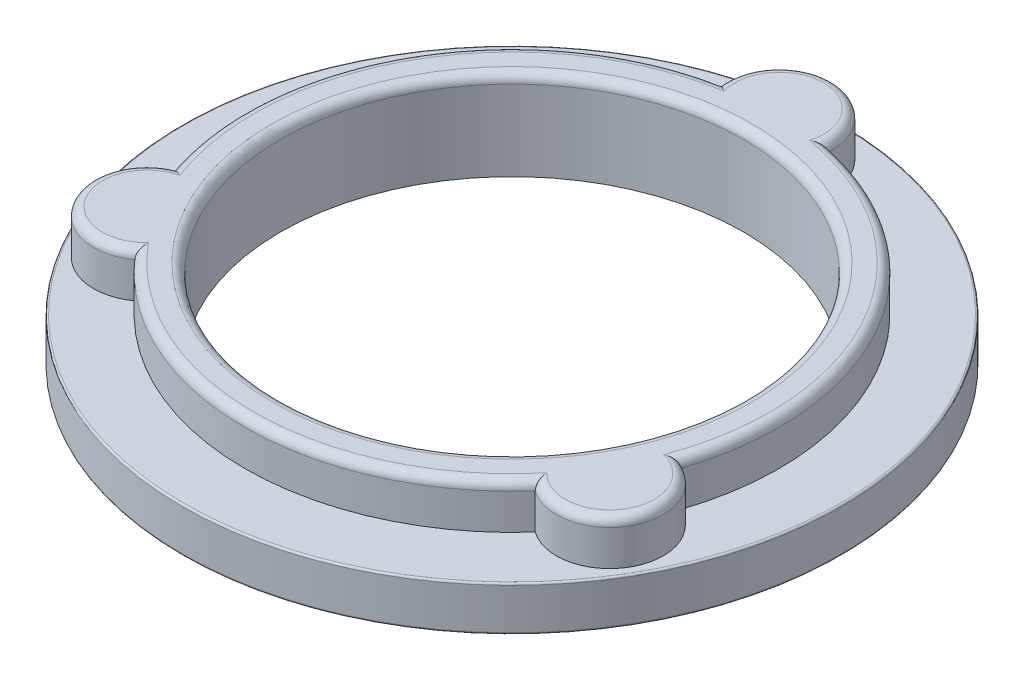
ISO-10303-21;
HEADER;
FILE_DESCRIPTION(('STEP AP214'),'2;1');
FILE_NAME('part.step','',(''),(''),'','','');
FILE_SCHEMA(('AUTOMOTIVE_DESIGN { 1 0 10303 214 1 1 1 1 }'));
ENDSEC;
DATA;
#1=APPLICATION_CONTEXT('core data for automotive mechanical design processes');
#2=APPLICATION_PROTOCOL_DEFINITION('international standard','automotive_design',2000,#1);
#3=PRODUCT_CONTEXT('',#1,'mechanical');
#4=PRODUCT('Part','Part','',(#3));
#5=PRODUCT_RELATED_PRODUCT_CATEGORY('part','',(#4));
#6=PRODUCT_DEFINITION_FORMATION('','',#4);
#7=PRODUCT_DEFINITION_CONTEXT('part definition',#1,'design');
#8=PRODUCT_DEFINITION('design','',#6,#7);
#9=PRODUCT_DEFINITION_SHAPE('','',#8);
#10=(LENGTH_UNIT() NAMED_UNIT(*) SI_UNIT(.MILLI.,.METRE.));
#11=(NAMED_UNIT(*) PLANE_ANGLE_UNIT() SI_UNIT($,.RADIAN.));
#12=(NAMED_UNIT(*) SI_UNIT($,.STERADIAN.) SOLID_ANGLE_UNIT());
#13=UNCERTAINTY_MEASURE_WITH_UNIT(LENGTH_MEASURE(1.E-05),#10,'distance_accuracy_value','');
#14=(GEOMETRIC_REPRESENTATION_CONTEXT(3) GLOBAL_UNCERTAINTY_ASSIGNED_CONTEXT((#13)) GLOBAL_UNIT_ASSIGNED_CONTEXT((#10,
#11,#12)) REPRESENTATION_CONTEXT('',''));
#15=CARTESIAN_POINT('',(0.,0.,0.));
#16=DIRECTION('',(0.,0.,1.));
#17=DIRECTION('',(1.,0.,0.));
#18=AXIS2_PLACEMENT_3D('',#15,#16,#17);
#19=CARTESIAN_POINT('',(0.,2.5,0.));
#20=DIRECTION('',(0.,-1.,0.));
#21=DIRECTION('',(0.,0.,-1.));
#22=AXIS2_PLACEMENT_3D('',#19,#20,#21);
#23=CYLINDRICAL_SURFACE('',#22,13.);
#24=CARTESIAN_POINT('',(0.,4.5,0.));
#25=DIRECTION('',(0.,1.,0.));
#26=DIRECTION('',(0.,0.,1.));
#27=AXIS2_PLACEMENT_3D('',#24,#25,#26);
#28=CIRCLE('',#27,13.);
#29=CARTESIAN_POINT('',(0.,4.5,13.));
#30=VERTEX_POINT('',#29);
#31=EDGE_CURVE('E205',#30,#30,#28,.T.);
#32=ORIENTED_EDGE('',*,*,#31,.T.);
#33=EDGE_LOOP('',(#32));
#34=FACE_BOUND('',#33,.T.);
#35=CARTESIAN_POINT('',(0.,0.,0.));
#36=DIRECTION('',(0.,1.,0.));
#37=DIRECTION('',(0.,0.,1.));
#38=AXIS2_PLACEMENT_3D('',#35,#36,#37);
#39=CIRCLE('',#38,13.);
#40=CARTESIAN_POINT('',(0.,0.,13.));
#41=VERTEX_POINT('',#40);
#42=EDGE_CURVE('E119',#41,#41,#39,.T.);
#43=ORIENTED_EDGE('',*,*,#42,.F.);
#44=EDGE_LOOP('',(#43));
#45=FACE_BOUND('',#44,.T.);
#46=ADVANCED_FACE('F39',(#34,#45),#23,.F.);
#47=CARTESIAN_POINT('',(0.,2.5,0.));
#48=DIRECTION('',(0.,-1.,0.));
#49=DIRECTION('',(0.,0.,-1.));
#50=AXIS2_PLACEMENT_3D('',#47,#48,#49);
#51=CYLINDRICAL_SURFACE('',#50,18.5);
#52=CARTESIAN_POINT('',(0.,0.0999999999999998,0.));
#53=DIRECTION('',(0.,1.,0.));
#54=DIRECTION('',(0.,0.,1.));
#55=AXIS2_PLACEMENT_3D('',#52,#53,#54);
#56=CIRCLE('',#55,18.5);
#57=CARTESIAN_POINT('',(0.,0.0999999999999998,18.5));
#58=VERTEX_POINT('',#57);
#59=EDGE_CURVE('E283',#58,#58,#56,.T.);
#60=ORIENTED_EDGE('',*,*,#59,.T.);
#61=EDGE_LOOP('',(#60));
#62=FACE_BOUND('',#61,.T.);
#63=CARTESIAN_POINT('',(0.,2.4,0.));
#64=DIRECTION('',(0.,1.,0.));
#65=DIRECTION('',(0.,0.,1.));
#66=AXIS2_PLACEMENT_3D('',#63,#64,#65);
#67=CIRCLE('',#66,18.5);
#68=CARTESIAN_POINT('',(0.,2.4,18.5));
#69=VERTEX_POINT('',#68);
#70=EDGE_CURVE('E209',#69,#69,#67,.F.);
#71=ORIENTED_EDGE('',*,*,#70,.T.);
#72=EDGE_LOOP('',(#71));
#73=FACE_BOUND('',#72,.T.);
#74=ADVANCED_FACE('F298',(#62,#73),#51,.T.);
#75=CARTESIAN_POINT('',(0.,2.5,0.));
#76=DIRECTION('',(0.,1.,0.));
#77=DIRECTION('',(0.,0.,1.));
#78=AXIS2_PLACEMENT_3D('',#75,#76,#77);
#79=PLANE('',#78);
#80=CARTESIAN_POINT('',(0.,2.5,0.));
#81=DIRECTION('',(0.,1.,0.));
#82=DIRECTION('',(0.,0.,1.));
#83=AXIS2_PLACEMENT_3D('',#80,#81,#82);
#84=CIRCLE('',#83,18.4);
#85=CARTESIAN_POINT('',(0.,2.5,18.4));
#86=VERTEX_POINT('',#85);
#87=EDGE_CURVE('E11',#86,#86,#84,.T.);
#88=ORIENTED_EDGE('',*,*,#87,.T.);
#89=EDGE_LOOP('',(#88));
#90=FACE_BOUND('',#89,.T.);
#91=CARTESIAN_POINT('',(12.9903810567665,2.5,7.50000000000006));
#92=DIRECTION('',(0.,1.,0.));
#93=DIRECTION('',(0.,0.,1.));
#94=AXIS2_PLACEMENT_3D('',#91,#92,#93);
#95=CIRCLE('',#94,3.00000000000001);
#96=CARTESIAN_POINT('',(11.2380922799713,2.5,9.93505319094218));
#97=VERTEX_POINT('',#96);
#98=CARTESIAN_POINT('',(14.2230545912912,2.5,4.76494680905793));
#99=VERTEX_POINT('',#98);
#100=EDGE_CURVE('E114',#97,#99,#95,.T.);
#101=ORIENTED_EDGE('',*,*,#100,.F.);
#102=CARTESIAN_POINT('',(0.,2.5,0.));
#103=DIRECTION('',(0.,1.,0.));
#104=DIRECTION('',(0.,0.,1.));
#105=AXIS2_PLACEMENT_3D('',#102,#103,#104);
#106=CIRCLE('',#105,15.);
#107=CARTESIAN_POINT('',(-11.2380922799714,2.5,9.93505319094202));
#108=VERTEX_POINT('',#107);
#109=EDGE_CURVE('E123',#108,#97,#106,.T.);
#110=ORIENTED_EDGE('',*,*,#109,.F.);
#111=CARTESIAN_POINT('',(-12.9903810567666,2.5,7.49999999999988));
#112=DIRECTION('',(0.,1.,0.));
#113=DIRECTION('',(0.,0.,1.));
#114=AXIS2_PLACEMENT_3D('',#111,#112,#113);
#115=CIRCLE('',#114,3.00000000000001);
#116=CARTESIAN_POINT('',(-14.2230545912912,2.5,4.76494680905774));
#117=VERTEX_POINT('',#116);
#118=EDGE_CURVE('E146',#117,#108,#115,.T.);
#119=ORIENTED_EDGE('',*,*,#118,.F.);
#120=CARTESIAN_POINT('',(-2.98496231131988,2.5,-14.7));
#121=VERTEX_POINT('',#120);
#122=EDGE_CURVE('E133',#121,#117,#106,.T.);
#123=ORIENTED_EDGE('',*,*,#122,.F.);
#124=CARTESIAN_POINT('',(0.,2.5,-15.));
#125=DIRECTION('',(0.,1.,0.));
#126=DIRECTION('',(0.,0.,1.));
#127=AXIS2_PLACEMENT_3D('',#124,#125,#126);
#128=CIRCLE('',#127,3.00000000000001);
#129=CARTESIAN_POINT('',(2.98496231131988,2.5,-14.7));
#130=VERTEX_POINT('',#129);
#131=EDGE_CURVE('E141',#130,#121,#128,.T.);
#132=ORIENTED_EDGE('',*,*,#131,.F.);
#133=EDGE_CURVE('E134',#99,#130,#106,.T.);
#134=ORIENTED_EDGE('',*,*,#133,.F.);
#135=EDGE_LOOP('',(#101,#110,#119,#123,#132,#134));
#136=FACE_BOUND('',#135,.T.);
#137=ADVANCED_FACE('F135',(#90,#136),#79,.T.);
#138=CARTESIAN_POINT('',(0.,0.,0.));
#139=DIRECTION('',(0.,1.,0.));
#140=DIRECTION('',(0.,0.,1.));
#141=AXIS2_PLACEMENT_3D('',#138,#139,#140);
#142=PLANE('',#141);
#143=CARTESIAN_POINT('',(0.,0.,0.));
#144=DIRECTION('',(0.,1.,0.));
#145=DIRECTION('',(0.,0.,1.));
#146=AXIS2_PLACEMENT_3D('',#143,#144,#145);
#147=CIRCLE('',#146,18.4);
#148=CARTESIAN_POINT('',(0.,0.,18.4));
#149=VERTEX_POINT('',#148);
#150=EDGE_CURVE('E48',#149,#149,#147,.F.);
#151=ORIENTED_EDGE('',*,*,#150,.T.);
#152=EDGE_LOOP('',(#151));
#153=FACE_BOUND('',#152,.T.);
#154=ORIENTED_EDGE('',*,*,#42,.T.);
#155=EDGE_LOOP('',(#154));
#156=FACE_BOUND('',#155,.T.);
#157=ADVANCED_FACE('F290',(#153,#156),#142,.F.);
#158=CARTESIAN_POINT('',(0.,5.,0.));
#159=DIRECTION('',(0.,-1.,0.));
#160=DIRECTION('',(0.,0.,-1.));
#161=AXIS2_PLACEMENT_3D('',#158,#159,#160);
#162=CYLINDRICAL_SURFACE('',#161,15.);
#163=DIRECTION('',(0.,-1.,0.));
#164=VECTOR('',#163,1.);
#165=CARTESIAN_POINT('',(11.2380922799713,5.,9.93505319094218));
#166=LINE('',#165,#164);
#167=CARTESIAN_POINT('',(11.2380922799713,4.5,9.93505319094218));
#168=VERTEX_POINT('',#167);
#169=EDGE_CURVE('E110',#168,#97,#166,.T.);
#170=ORIENTED_EDGE('',*,*,#169,.F.);
#171=CARTESIAN_POINT('',(0.,4.5,0.));
#172=DIRECTION('',(0.,1.,0.));
#173=DIRECTION('',(0.,0.,1.));
#174=AXIS2_PLACEMENT_3D('',#171,#172,#173);
#175=CIRCLE('',#174,15.);
#176=CARTESIAN_POINT('',(-11.2380922799714,4.5,9.93505319094202));
#177=VERTEX_POINT('',#176);
#178=EDGE_CURVE('E202',#168,#177,#175,.F.);
#179=ORIENTED_EDGE('',*,*,#178,.T.);
#180=DIRECTION('',(0.,-1.,0.));
#181=VECTOR('',#180,1.);
#182=CARTESIAN_POINT('',(-11.2380922799714,5.,9.93505319094202));
#183=LINE('',#182,#181);
#184=EDGE_CURVE('E126',#177,#108,#183,.T.);
#185=ORIENTED_EDGE('',*,*,#184,.T.);
#186=ORIENTED_EDGE('',*,*,#109,.T.);
#187=EDGE_LOOP('',(#170,#179,#185,#186));
#188=FACE_BOUND('',#187,.T.);
#189=ADVANCED_FACE('F124',(#188),#162,.T.);
#190=CARTESIAN_POINT('',(12.9903810567665,5.,7.50000000000006));
#191=DIRECTION('',(0.,-1.,0.));
#192=DIRECTION('',(0.,0.,-1.));
#193=AXIS2_PLACEMENT_3D('',#190,#191,#192);
#194=CYLINDRICAL_SURFACE('',#193,3.00000000000001);
#195=DIRECTION('',(0.,-1.,0.));
#196=VECTOR('',#195,1.);
#197=CARTESIAN_POINT('',(14.2230545912912,5.,4.76494680905793));
#198=LINE('',#197,#196);
#199=CARTESIAN_POINT('',(14.2230545912912,4.5,4.76494680905793));
#200=VERTEX_POINT('',#199);
#201=EDGE_CURVE('E120',#200,#99,#198,.T.);
#202=ORIENTED_EDGE('',*,*,#201,.F.);
#203=CARTESIAN_POINT('',(12.9903810567665,4.5,7.50000000000006));
#204=DIRECTION('',(0.,1.,0.));
#205=DIRECTION('',(0.,0.,1.));
#206=AXIS2_PLACEMENT_3D('',#203,#204,#205);
#207=CIRCLE('',#206,3.00000000000001);
#208=EDGE_CURVE('E55',#200,#168,#207,.F.);
#209=ORIENTED_EDGE('',*,*,#208,.T.);
#210=ORIENTED_EDGE('',*,*,#169,.T.);
#211=ORIENTED_EDGE('',*,*,#100,.T.);
#212=EDGE_LOOP('',(#202,#209,#210,#211));
#213=FACE_BOUND('',#212,.T.);
#214=ADVANCED_FACE('F112',(#213),#194,.T.);
#215=DIRECTION('',(0.,-1.,0.));
#216=VECTOR('',#215,1.);
#217=CARTESIAN_POINT('',(2.98496231131988,5.,-14.7));
#218=LINE('',#217,#216);
#219=CARTESIAN_POINT('',(2.98496231131988,4.5,-14.7));
#220=VERTEX_POINT('',#219);
#221=EDGE_CURVE('E157',#220,#130,#218,.T.);
#222=ORIENTED_EDGE('',*,*,#221,.F.);
#223=CARTESIAN_POINT('',(0.,4.5,0.));
#224=DIRECTION('',(0.,1.,0.));
#225=DIRECTION('',(0.,0.,1.));
#226=AXIS2_PLACEMENT_3D('',#223,#224,#225);
#227=CIRCLE('',#226,15.);
#228=EDGE_CURVE('E63',#220,#200,#227,.F.);
#229=ORIENTED_EDGE('',*,*,#228,.T.);
#230=ORIENTED_EDGE('',*,*,#201,.T.);
#231=ORIENTED_EDGE('',*,*,#133,.T.);
#232=EDGE_LOOP('',(#222,#229,#230,#231));
#233=FACE_BOUND('',#232,.T.);
#234=ADVANCED_FACE('F345',(#233),#162,.T.);
#235=CARTESIAN_POINT('',(0.,5.,-15.));
#236=DIRECTION('',(0.,-1.,0.));
#237=DIRECTION('',(0.,0.,-1.));
#238=AXIS2_PLACEMENT_3D('',#235,#236,#237);
#239=CYLINDRICAL_SURFACE('',#238,3.00000000000001);
#240=DIRECTION('',(0.,-1.,0.));
#241=VECTOR('',#240,1.);
#242=CARTESIAN_POINT('',(-2.98496231131988,5.,-14.7));
#243=LINE('',#242,#241);
#244=CARTESIAN_POINT('',(-2.98496231131988,4.5,-14.7));
#245=VERTEX_POINT('',#244);
#246=EDGE_CURVE('E154',#245,#121,#243,.T.);
#247=ORIENTED_EDGE('',*,*,#246,.F.);
#248=CARTESIAN_POINT('',(0.,4.5,-15.));
#249=DIRECTION('',(0.,1.,0.));
#250=DIRECTION('',(0.,0.,1.));
#251=AXIS2_PLACEMENT_3D('',#248,#249,#250);
#252=CIRCLE('',#251,3.00000000000001);
#253=EDGE_CURVE('E195',#245,#220,#252,.F.);
#254=ORIENTED_EDGE('',*,*,#253,.T.);
#255=ORIENTED_EDGE('',*,*,#221,.T.);
#256=ORIENTED_EDGE('',*,*,#131,.T.);
#257=EDGE_LOOP('',(#247,#254,#255,#256));
#258=FACE_BOUND('',#257,.T.);
#259=ADVANCED_FACE('F343',(#258),#239,.T.);
#260=DIRECTION('',(0.,-1.,0.));
#261=VECTOR('',#260,1.);
#262=CARTESIAN_POINT('',(-14.2230545912912,5.,4.76494680905774));
#263=LINE('',#262,#261);
#264=CARTESIAN_POINT('',(-14.2230545912912,4.5,4.76494680905774));
#265=VERTEX_POINT('',#264);
#266=EDGE_CURVE('E151',#265,#117,#263,.T.);
#267=ORIENTED_EDGE('',*,*,#266,.F.);
#268=CARTESIAN_POINT('',(0.,4.5,0.));
#269=DIRECTION('',(0.,1.,0.));
#270=DIRECTION('',(0.,0.,1.));
#271=AXIS2_PLACEMENT_3D('',#268,#269,#270);
#272=CIRCLE('',#271,15.);
#273=EDGE_CURVE('E192',#265,#245,#272,.F.);
#274=ORIENTED_EDGE('',*,*,#273,.T.);
#275=ORIENTED_EDGE('',*,*,#246,.T.);
#276=ORIENTED_EDGE('',*,*,#122,.T.);
#277=EDGE_LOOP('',(#267,#274,#275,#276));
#278=FACE_BOUND('',#277,.T.);
#279=ADVANCED_FACE('F337',(#278),#162,.T.);
#280=CARTESIAN_POINT('',(-12.9903810567666,5.,7.49999999999988));
#281=DIRECTION('',(0.,-1.,0.));
#282=DIRECTION('',(0.,0.,-1.));
#283=AXIS2_PLACEMENT_3D('',#280,#281,#282);
#284=CYLINDRICAL_SURFACE('',#283,3.00000000000001);
#285=ORIENTED_EDGE('',*,*,#184,.F.);
#286=CARTESIAN_POINT('',(-12.9903810567666,4.5,7.49999999999988));
#287=DIRECTION('',(0.,1.,0.));
#288=DIRECTION('',(0.,0.,1.));
#289=AXIS2_PLACEMENT_3D('',#286,#287,#288);
#290=CIRCLE('',#289,3.00000000000001);
#291=EDGE_CURVE('E188',#177,#265,#290,.F.);
#292=ORIENTED_EDGE('',*,*,#291,.T.);
#293=ORIENTED_EDGE('',*,*,#266,.T.);
#294=ORIENTED_EDGE('',*,*,#118,.T.);
#295=EDGE_LOOP('',(#285,#292,#293,#294));
#296=FACE_BOUND('',#295,.T.);
#297=ADVANCED_FACE('F329',(#296),#284,.T.);
#298=CARTESIAN_POINT('',(0.,5.,0.));
#299=DIRECTION('',(0.,1.,0.));
#300=DIRECTION('',(0.,0.,1.));
#301=AXIS2_PLACEMENT_3D('',#298,#299,#300);
#302=PLANE('',#301);
#303=CARTESIAN_POINT('',(0.,5.,0.));
#304=DIRECTION('',(0.,1.,0.));
#305=DIRECTION('',(0.,0.,1.));
#306=AXIS2_PLACEMENT_3D('',#303,#304,#305);
#307=CIRCLE('',#306,14.5);
#308=CARTESIAN_POINT('',(-2.40000000000001,5.,-14.3));
#309=VERTEX_POINT('',#308);
#310=CARTESIAN_POINT('',(-13.5841632741175,5.,5.07153903091721));
#311=VERTEX_POINT('',#310);
#312=EDGE_CURVE('E181',#309,#311,#307,.T.);
#313=ORIENTED_EDGE('',*,*,#312,.T.);
#314=CARTESIAN_POINT('',(-12.9903810567666,5.,7.49999999999988));
#315=DIRECTION('',(0.,1.,0.));
#316=DIRECTION('',(0.,0.,1.));
#317=AXIS2_PLACEMENT_3D('',#314,#315,#316);
#318=CIRCLE('',#317,2.50000000000001);
#319=CARTESIAN_POINT('',(-11.1841632741175,5.,9.22846096908256));
#320=VERTEX_POINT('',#319);
#321=EDGE_CURVE('E184',#311,#320,#318,.T.);
#322=ORIENTED_EDGE('',*,*,#321,.T.);
#323=CARTESIAN_POINT('',(0.,5.,0.));
#324=DIRECTION('',(0.,1.,0.));
#325=DIRECTION('',(0.,0.,1.));
#326=AXIS2_PLACEMENT_3D('',#323,#324,#325);
#327=CIRCLE('',#326,14.5);
#328=CARTESIAN_POINT('',(11.1841632741174,5.,9.22846096908271));
#329=VERTEX_POINT('',#328);
#330=EDGE_CURVE('E169',#320,#329,#327,.T.);
#331=ORIENTED_EDGE('',*,*,#330,.T.);
#332=CARTESIAN_POINT('',(12.9903810567665,5.,7.50000000000006));
#333=DIRECTION('',(0.,1.,0.));
#334=DIRECTION('',(0.,0.,1.));
#335=AXIS2_PLACEMENT_3D('',#332,#333,#334);
#336=CIRCLE('',#335,2.50000000000001);
#337=CARTESIAN_POINT('',(13.5841632741175,5.,5.0715390309174));
#338=VERTEX_POINT('',#337);
#339=EDGE_CURVE('E172',#329,#338,#336,.T.);
#340=ORIENTED_EDGE('',*,*,#339,.T.);
#341=CARTESIAN_POINT('',(0.,5.,0.));
#342=DIRECTION('',(0.,1.,0.));
#343=DIRECTION('',(0.,0.,1.));
#344=AXIS2_PLACEMENT_3D('',#341,#342,#343);
#345=CIRCLE('',#344,14.5);
#346=CARTESIAN_POINT('',(2.40000000000001,5.,-14.3));
#347=VERTEX_POINT('',#346);
#348=EDGE_CURVE('E175',#338,#347,#345,.T.);
#349=ORIENTED_EDGE('',*,*,#348,.T.);
#350=CARTESIAN_POINT('',(0.,5.,-15.));
#351=DIRECTION('',(0.,1.,0.));
#352=DIRECTION('',(0.,0.,1.));
#353=AXIS2_PLACEMENT_3D('',#350,#351,#352);
#354=CIRCLE('',#353,2.50000000000001);
#355=EDGE_CURVE('E178',#347,#309,#354,.T.);
#356=ORIENTED_EDGE('',*,*,#355,.T.);
#357=EDGE_LOOP('',(#313,#322,#331,#340,#349,#356));
#358=FACE_BOUND('',#357,.T.);
#359=CARTESIAN_POINT('',(0.,5.,0.));
#360=DIRECTION('',(0.,1.,0.));
#361=DIRECTION('',(0.,0.,1.));
#362=AXIS2_PLACEMENT_3D('',#359,#360,#361);
#363=CIRCLE('',#362,13.5);
#364=CARTESIAN_POINT('',(0.,5.,13.5));
#365=VERTEX_POINT('',#364);
#366=EDGE_CURVE('E165',#365,#365,#363,.F.);
#367=ORIENTED_EDGE('',*,*,#366,.T.);
#368=EDGE_LOOP('',(#367));
#369=FACE_BOUND('',#368,.T.);
#370=ADVANCED_FACE('F327',(#358,#369),#302,.T.);
#371=CARTESIAN_POINT('',(0.,4.5,0.));
#372=DIRECTION('',(0.,1.,0.));
#373=DIRECTION('',(0.,0.,1.));
#374=AXIS2_PLACEMENT_3D('',#371,#372,#373);
#375=TOROIDAL_SURFACE('',#374,14.5,0.5);
#376=CARTESIAN_POINT('',(14.2230545912912,4.5,4.76494680905794));
#377=CARTESIAN_POINT('',(14.2230986461439,4.52290086483907,4.76492990888616));
#378=CARTESIAN_POINT('',(14.2211138308867,4.54575667348987,4.76579502583611));
#379=CARTESIAN_POINT('',(14.2134596538503,4.59055664061278,4.76914439087964));
#380=CARTESIAN_POINT('',(14.2078170215838,4.61250619346143,4.77161689336969));
#381=CARTESIAN_POINT('',(14.1932254125642,4.6549798030937,4.77803340928671));
#382=CARTESIAN_POINT('',(14.1842830211207,4.67550660299374,4.78197449203012));
#383=CARTESIAN_POINT('',(14.1636029555722,4.71481428076269,4.79113292590591));
#384=CARTESIAN_POINT('',(14.1518602708362,4.733591944133,4.79635256525005));
#385=CARTESIAN_POINT('',(14.1217057976028,4.77523021394123,4.80983499670389));
#386=CARTESIAN_POINT('',(14.102386185781,4.79729384761773,4.81852821545392));
#387=CARTESIAN_POINT('',(14.0608157544754,4.83769304181867,4.837411788382));
#388=CARTESIAN_POINT('',(14.0385600954145,4.85602231712821,4.84760461768192));
#389=CARTESIAN_POINT('',(13.98361583311,4.89503617883405,4.87303707983414));
#390=CARTESIAN_POINT('',(13.9500635049846,4.91417812283979,4.88876937102921));
#391=CARTESIAN_POINT('',(13.8808575057951,4.9463343188024,4.92174850481852));
#392=CARTESIAN_POINT('',(13.8452008316324,4.95933956297362,4.93899753000382));
#393=CARTESIAN_POINT('',(13.7727149351566,4.97988073156558,4.97467332239887));
#394=CARTESIAN_POINT('',(13.7358806893475,4.98738862518475,4.99310561147653));
#395=CARTESIAN_POINT('',(13.6620141574801,4.99735691379744,5.03074953772222));
#396=CARTESIAN_POINT('',(13.6249823153393,4.99982588023516,5.04995979465093));
#397=CARTESIAN_POINT('',(13.5868075921788,4.9999970325172,5.07013977374818));
#398=CARTESIAN_POINT('',(13.5854853103202,4.99999999493496,5.07083923116509));
#399=CARTESIAN_POINT('',(13.5841632741175,5.,5.0715390309174));
#400=B_SPLINE_CURVE_WITH_KNOTS('',3,(#376,#377,#378,#379,#380,#381,#382,#383,#384,#385,#386,
#387,#388,#389,#390,#391,#392,#393,#394,#395,#396,#397,#398,#399),.UNSPECIFIED.,.F.,.F.,(4,2,2,
2,2,2,2,2,2,2,2,4),(0.,0.0685290676804235,0.136562919548022,0.204461724580458,0.272482946400404,
0.363744339565083,0.455158086432355,0.579607636059305,0.7042392956554,0.829502104630917,
0.954551657678307,0.959039304009294),.UNSPECIFIED.);
#401=EDGE_CURVE('E253',#200,#338,#400,.T.);
#402=ORIENTED_EDGE('',*,*,#401,.F.);
#403=ORIENTED_EDGE('',*,*,#228,.F.);
#404=CARTESIAN_POINT('',(2.98496231131988,4.5,-14.7));
#405=CARTESIAN_POINT('',(2.98499897472432,4.52290086483907,-14.7000297025357));
#406=CARTESIAN_POINT('',(2.98325735383983,4.54575667348987,-14.6987433605762));
#407=CARTESIAN_POINT('',(2.97652963010741,4.59055664061278,-14.6937893313394));
#408=CARTESIAN_POINT('',(2.97156706400682,4.61250619346143,-14.6901389196973));
#409=CARTESIAN_POINT('',(2.95871439370913,4.6549798030937,-14.6807104735629));
#410=CARTESIAN_POINT('',(2.95083012021314,4.67550660299374,-14.6749366767738));
#411=CARTESIAN_POINT('',(2.93255865104357,4.71481428076269,-14.6616064315948));
#412=CARTESIAN_POINT('',(2.92216696840496,4.733591944133,-14.6540467879769));
#413=CARTESIAN_POINT('',(2.89541360364445,4.77523021394122,-14.6346734638459));
#414=CARTESIAN_POINT('',(2.87822524945539,4.79729384761773,-14.6222887985921));
#415=CARTESIAN_POINT('',(2.84108637993264,4.83769304181867,-14.5957295354991));
#416=CARTESIAN_POINT('',(2.821131301292,4.85602231712821,-14.5815519840244));
#417=CARTESIAN_POINT('',(2.77163401183515,4.89503617883405,-14.5466850881526));
#418=CARTESIAN_POINT('',(2.74123328393778,4.91417812283979,-14.5254940652374));
#419=CARTESIAN_POINT('',(2.67806951668672,4.94633431880239,-14.4820494787397));
#420=CARTESIAN_POINT('',(2.64530308560437,4.95933956297362,-14.459794405693));
#421=CARTESIAN_POINT('',(2.57816399485222,4.97988073156558,-14.4148576741264));
#422=CARTESIAN_POINT('',(2.54378404135651,4.98738862518475,-14.3921744260653));
#423=CARTESIAN_POINT('',(2.47425017899588,4.99735691379744,-14.3470260961015));
#424=CARTESIAN_POINT('',(2.43909768741201,4.99982588023516,-14.324560708523));
#425=CARTESIAN_POINT('',(2.40253395128566,4.9999970325172,-14.3015904180322));
#426=CARTESIAN_POINT('',(2.40126706246444,4.99999999493496,-14.3007950170601));
#427=CARTESIAN_POINT('',(2.40000000000001,5.,-14.3));
#428=B_SPLINE_CURVE_WITH_KNOTS('',3,(#404,#405,#406,#407,#408,#409,#410,#411,#412,#413,#414,
#415,#416,#417,#418,#419,#420,#421,#422,#423,#424,#425,#426,#427),.UNSPECIFIED.,.F.,.F.,(4,2,2,
2,2,2,2,2,2,2,2,4),(0.,0.0685290676804233,0.136562919548022,0.204461724580457,0.272482946400402,
0.36374433956508,0.455158086432352,0.5796076360593,0.704239295655397,0.829502104630915,
0.954551657678307,0.959039304009293),.UNSPECIFIED.);
#429=EDGE_CURVE('E131',#347,#220,#428,.F.);
#430=ORIENTED_EDGE('',*,*,#429,.F.);
#431=ORIENTED_EDGE('',*,*,#348,.F.);
#432=EDGE_LOOP('',(#402,#403,#430,#431));
#433=FACE_BOUND('',#432,.T.);
#434=ADVANCED_FACE('F268',(#433),#375,.T.);
#435=CARTESIAN_POINT('',(0.,4.5,-15.));
#436=DIRECTION('',(0.,1.,0.));
#437=DIRECTION('',(0.,0.,1.));
#438=AXIS2_PLACEMENT_3D('',#435,#436,#437);
#439=TOROIDAL_SURFACE('',#438,2.50000000000001,0.5);
#440=ORIENTED_EDGE('',*,*,#429,.T.);
#441=ORIENTED_EDGE('',*,*,#253,.F.);
#442=CARTESIAN_POINT('',(-2.98496231131988,4.5,-14.7));
#443=CARTESIAN_POINT('',(-2.98499897472432,4.52290086483907,-14.7000297025357));
#444=CARTESIAN_POINT('',(-2.98325735383983,4.54575667348987,-14.6987433605762));
#445=CARTESIAN_POINT('',(-2.97652963010741,4.59055664061278,-14.6937893313394));
#446=CARTESIAN_POINT('',(-2.97156706400682,4.61250619346143,-14.6901389196973));
#447=CARTESIAN_POINT('',(-2.95871439370913,4.6549798030937,-14.6807104735629));
#448=CARTESIAN_POINT('',(-2.95083012021314,4.67550660299374,-14.6749366767738));
#449=CARTESIAN_POINT('',(-2.93255865104357,4.71481428076269,-14.6616064315948));
#450=CARTESIAN_POINT('',(-2.92216696840496,4.733591944133,-14.6540467879769));
#451=CARTESIAN_POINT('',(-2.89541360364445,4.77523021394122,-14.6346734638459));
#452=CARTESIAN_POINT('',(-2.87822524945539,4.79729384761773,-14.6222887985921));
#453=CARTESIAN_POINT('',(-2.84108637993264,4.83769304181867,-14.5957295354991));
#454=CARTESIAN_POINT('',(-2.821131301292,4.85602231712821,-14.5815519840244));
#455=CARTESIAN_POINT('',(-2.77163401183515,4.89503617883405,-14.5466850881526));
#456=CARTESIAN_POINT('',(-2.74123328393778,4.91417812283979,-14.5254940652374));
#457=CARTESIAN_POINT('',(-2.67806951668672,4.94633431880239,-14.4820494787397));
#458=CARTESIAN_POINT('',(-2.64530308560437,4.95933956297362,-14.459794405693));
#459=CARTESIAN_POINT('',(-2.57816399485222,4.97988073156558,-14.4148576741264));
#460=CARTESIAN_POINT('',(-2.54378404135651,4.98738862518475,-14.3921744260653));
#461=CARTESIAN_POINT('',(-2.47425017899588,4.99735691379744,-14.3470260961015));
#462=CARTESIAN_POINT('',(-2.43909768741201,4.99982588023516,-14.324560708523));
#463=CARTESIAN_POINT('',(-2.40253395128566,4.9999970325172,-14.3015904180322));
#464=CARTESIAN_POINT('',(-2.40126706246444,4.99999999493496,-14.3007950170601));
#465=CARTESIAN_POINT('',(-2.40000000000001,5.,-14.3));
#466=B_SPLINE_CURVE_WITH_KNOTS('',3,(#442,#443,#444,#445,#446,#447,#448,#449,#450,#451,#452,
#453,#454,#455,#456,#457,#458,#459,#460,#461,#462,#463,#464,#465),.UNSPECIFIED.,.F.,.F.,(4,2,2,
2,2,2,2,2,2,2,2,4),(0.,0.0685290676804233,0.136562919548022,0.204461724580457,0.272482946400402,
0.36374433956508,0.455158086432352,0.5796076360593,0.704239295655397,0.829502104630915,
0.954551657678307,0.959039304009293),.UNSPECIFIED.);
#467=EDGE_CURVE('E245',#309,#245,#466,.F.);
#468=ORIENTED_EDGE('',*,*,#467,.F.);
#469=ORIENTED_EDGE('',*,*,#355,.F.);
#470=EDGE_LOOP('',(#440,#441,#468,#469));
#471=FACE_BOUND('',#470,.T.);
#472=ADVANCED_FACE('F265',(#471),#439,.T.);
#473=CARTESIAN_POINT('',(12.9903810567665,4.5,7.50000000000006));
#474=DIRECTION('',(0.,1.,0.));
#475=DIRECTION('',(0.,0.,1.));
#476=AXIS2_PLACEMENT_3D('',#473,#474,#475);
#477=TOROIDAL_SURFACE('',#476,2.50000000000001,0.5);
#478=ORIENTED_EDGE('',*,*,#401,.T.);
#479=ORIENTED_EDGE('',*,*,#339,.F.);
#480=CARTESIAN_POINT('',(11.2380922799713,4.5,9.93505319094217));
#481=CARTESIAN_POINT('',(11.2380996714195,4.52290086483907,9.93509979364967));
#482=CARTESIAN_POINT('',(11.2378564770468,4.54575667348987,9.93294833474016));
#483=CARTESIAN_POINT('',(11.2369300237429,4.59055664061279,9.92464494045985));
#484=CARTESIAN_POINT('',(11.2362499575769,4.61250619346143,9.91852202632777));
#485=CARTESIAN_POINT('',(11.2345110188551,4.6549798030937,9.90267706427625));
#486=CARTESIAN_POINT('',(11.2334529009075,4.67550660299374,9.89296218474384));
#487=CARTESIAN_POINT('',(11.2310443045286,4.71481428076269,9.87047350568899));
#488=CARTESIAN_POINT('',(11.2296933024312,4.733591944133,9.85769422272694));
#489=CARTESIAN_POINT('',(11.2262921939583,4.77523021394122,9.82483846714217));
#490=CARTESIAN_POINT('',(11.2241609363256,4.79729384761773,9.80376058313825));
#491=CARTESIAN_POINT('',(11.2197293745427,4.83769304181867,9.75831774711724));
#492=CARTESIAN_POINT('',(11.2174287941224,4.85602231712821,9.73394736634255));
#493=CARTESIAN_POINT('',(11.2119818212748,4.89503617883405,9.67364800831856));
#494=CARTESIAN_POINT('',(11.2088302210468,4.91417812283979,9.63672469420831));
#495=CARTESIAN_POINT('',(11.2027879891084,4.94633431880239,9.56030097392132));
#496=CARTESIAN_POINT('',(11.199897746028,4.95933956297362,9.52079687568929));
#497=CARTESIAN_POINT('',(11.1945509403044,4.97988073156558,9.44018435172766));
#498=CARTESIAN_POINT('',(11.192096647991,4.98738862518475,9.39906881458889));
#499=CARTESIAN_POINT('',(11.1877639784842,4.99735691379744,9.31627655837944));
#500=CARTESIAN_POINT('',(11.1858846279272,4.99982588023516,9.27460091387222));
#501=CARTESIAN_POINT('',(11.1842736408931,4.9999970325172,9.23145064428414));
#502=CARTESIAN_POINT('',(11.1842182478557,4.99999999493496,9.22995578589517));
#503=CARTESIAN_POINT('',(11.1841632741174,5.,9.22846096908271));
#504=B_SPLINE_CURVE_WITH_KNOTS('',3,(#480,#481,#482,#483,#484,#485,#486,#487,#488,#489,#490,
#491,#492,#493,#494,#495,#496,#497,#498,#499,#500,#501,#502,#503),.UNSPECIFIED.,.F.,.F.,(4,2,2,
2,2,2,2,2,2,2,2,4),(0.,0.0685290676804243,0.136562919548023,0.204461724580457,0.272482946400403,
0.363744339565081,0.455158086432354,0.579607636059299,0.704239295655396,0.829502104630916,
0.954551657678307,0.959039304009294),.UNSPECIFIED.);
#505=EDGE_CURVE('E254',#168,#329,#504,.T.);
#506=ORIENTED_EDGE('',*,*,#505,.F.);
#507=ORIENTED_EDGE('',*,*,#208,.F.);
#508=EDGE_LOOP('',(#478,#479,#506,#507));
#509=FACE_BOUND('',#508,.T.);
#510=ADVANCED_FACE('F239',(#509),#477,.T.);
#511=CARTESIAN_POINT('',(0.,4.5,0.));
#512=DIRECTION('',(0.,1.,0.));
#513=DIRECTION('',(0.,0.,1.));
#514=AXIS2_PLACEMENT_3D('',#511,#512,#513);
#515=TOROIDAL_SURFACE('',#514,14.5,0.5);
#516=ORIENTED_EDGE('',*,*,#467,.T.);
#517=ORIENTED_EDGE('',*,*,#273,.F.);
#518=CARTESIAN_POINT('',(-14.2230545912912,4.5,4.76494680905774));
#519=CARTESIAN_POINT('',(-14.2230986461439,4.52290086483907,4.76492990888597));
#520=CARTESIAN_POINT('',(-14.2211138308868,4.54575667348987,4.76579502583591));
#521=CARTESIAN_POINT('',(-14.2134596538504,4.59055664061279,4.76914439087945));
#522=CARTESIAN_POINT('',(-14.2078170215838,4.61250619346143,4.7716168933695));
#523=CARTESIAN_POINT('',(-14.1932254125643,4.6549798030937,4.77803340928652));
#524=CARTESIAN_POINT('',(-14.1842830211207,4.67550660299374,4.78197449202992));
#525=CARTESIAN_POINT('',(-14.1636029555722,4.71481428076269,4.79113292590571));
#526=CARTESIAN_POINT('',(-14.1518602708363,4.733591944133,4.79635256524985));
#527=CARTESIAN_POINT('',(-14.1217057976029,4.77523021394122,4.8098349967037));
#528=CARTESIAN_POINT('',(-14.1023861857811,4.79729384761773,4.81852821545372));
#529=CARTESIAN_POINT('',(-14.0608157544754,4.83769304181867,4.8374117883818));
#530=CARTESIAN_POINT('',(-14.0385600954145,4.85602231712821,4.84760461768173));
#531=CARTESIAN_POINT('',(-13.98361583311,4.89503617883405,4.87303707983394));
#532=CARTESIAN_POINT('',(-13.9500635049846,4.91417812283979,4.88876937102902));
#533=CARTESIAN_POINT('',(-13.8808575057952,4.94633431880239,4.92174850481832));
#534=CARTESIAN_POINT('',(-13.8452008316325,4.95933956297362,4.93899753000362));
#535=CARTESIAN_POINT('',(-13.7727149351567,4.97988073156558,4.97467332239869));
#536=CARTESIAN_POINT('',(-13.7358806893476,4.98738862518475,4.99310561147635));
#537=CARTESIAN_POINT('',(-13.6620141574802,4.99735691379744,5.03074953772202));
#538=CARTESIAN_POINT('',(-13.6249823153394,4.99982588023516,5.04995979465073));
#539=CARTESIAN_POINT('',(-13.5868075921789,4.9999970325172,5.07013977374799));
#540=CARTESIAN_POINT('',(-13.5854853103203,4.99999999493496,5.0708392311649));
#541=CARTESIAN_POINT('',(-13.5841632741175,5.,5.07153903091721));
#542=B_SPLINE_CURVE_WITH_KNOTS('',3,(#518,#519,#520,#521,#522,#523,#524,#525,#526,#527,#528,
#529,#530,#531,#532,#533,#534,#535,#536,#537,#538,#539,#540,#541),.UNSPECIFIED.,.F.,.F.,(4,2,2,
2,2,2,2,2,2,2,2,4),(0.,0.0685290676804235,0.136562919548023,0.204461724580458,0.272482946400404,
0.363744339565082,0.455158086432355,0.579607636059303,0.704239295655397,0.829502104630918,
0.954551657678306,0.959039304009293),.UNSPECIFIED.);
#543=EDGE_CURVE('E219',#311,#265,#542,.F.);
#544=ORIENTED_EDGE('',*,*,#543,.F.);
#545=ORIENTED_EDGE('',*,*,#312,.F.);
#546=EDGE_LOOP('',(#516,#517,#544,#545));
#547=FACE_BOUND('',#546,.T.);
#548=ADVANCED_FACE('F234',(#547),#515,.T.);
#549=CARTESIAN_POINT('',(0.,4.5,0.));
#550=DIRECTION('',(0.,1.,0.));
#551=DIRECTION('',(0.,0.,1.));
#552=AXIS2_PLACEMENT_3D('',#549,#550,#551);
#553=TOROIDAL_SURFACE('',#552,14.5,0.5);
#554=ORIENTED_EDGE('',*,*,#505,.T.);
#555=ORIENTED_EDGE('',*,*,#330,.F.);
#556=CARTESIAN_POINT('',(-11.2380922799714,4.5,9.93505319094202));
#557=CARTESIAN_POINT('',(-11.2380996714197,4.52290086483907,9.93509979364952));
#558=CARTESIAN_POINT('',(-11.237856477047,4.54575667348987,9.93294833474));
#559=CARTESIAN_POINT('',(-11.2369300237431,4.59055664061279,9.9246449404597));
#560=CARTESIAN_POINT('',(-11.2362499575771,4.61250619346143,9.91852202632761));
#561=CARTESIAN_POINT('',(-11.2345110188552,4.6549798030937,9.9026770642761));
#562=CARTESIAN_POINT('',(-11.2334529009077,4.67550660299374,9.89296218474368));
#563=CARTESIAN_POINT('',(-11.2310443045287,4.71481428076269,9.87047350568884));
#564=CARTESIAN_POINT('',(-11.2296933024313,4.733591944133,9.85769422272679));
#565=CARTESIAN_POINT('',(-11.2262921939585,4.77523021394123,9.82483846714201));
#566=CARTESIAN_POINT('',(-11.2241609363258,4.79729384761773,9.80376058313809));
#567=CARTESIAN_POINT('',(-11.2197293745429,4.83769304181867,9.75831774711708));
#568=CARTESIAN_POINT('',(-11.2174287941226,4.85602231712821,9.7339473663424));
#569=CARTESIAN_POINT('',(-11.2119818212749,4.89503617883405,9.6736480083184));
#570=CARTESIAN_POINT('',(-11.2088302210469,4.91417812283979,9.63672469420816));
#571=CARTESIAN_POINT('',(-11.2027879891085,4.9463343188024,9.56030097392116));
#572=CARTESIAN_POINT('',(-11.1998977460281,4.95933956297362,9.52079687568913));
#573=CARTESIAN_POINT('',(-11.1945509403045,4.97988073156558,9.4401843517275));
#574=CARTESIAN_POINT('',(-11.1920966479911,4.98738862518475,9.39906881458873));
#575=CARTESIAN_POINT('',(-11.1877639784843,4.99735691379744,9.31627655837928));
#576=CARTESIAN_POINT('',(-11.1858846279274,4.99982588023516,9.27460091387206));
#577=CARTESIAN_POINT('',(-11.1842736408933,4.9999970325172,9.23145064428398));
#578=CARTESIAN_POINT('',(-11.1842182478559,4.99999999493496,9.22995578589501));
#579=CARTESIAN_POINT('',(-11.1841632741175,5.,9.22846096908256));
#580=B_SPLINE_CURVE_WITH_KNOTS('',3,(#556,#557,#558,#559,#560,#561,#562,#563,#564,#565,#566,
#567,#568,#569,#570,#571,#572,#573,#574,#575,#576,#577,#578,#579),.UNSPECIFIED.,.F.,.F.,(4,2,2,
2,2,2,2,2,2,2,2,4),(0.,0.0685290676804233,0.136562919548023,0.204461724580458,0.272482946400404,
0.363744339565083,0.455158086432355,0.579607636059305,0.704239295655402,0.829502104630919,
0.954551657678307,0.959039304009291),.UNSPECIFIED.);
#581=EDGE_CURVE('E210',#177,#320,#580,.T.);
#582=ORIENTED_EDGE('',*,*,#581,.F.);
#583=ORIENTED_EDGE('',*,*,#178,.F.);
#584=EDGE_LOOP('',(#554,#555,#582,#583));
#585=FACE_BOUND('',#584,.T.);
#586=ADVANCED_FACE('F226',(#585),#553,.T.);
#587=CARTESIAN_POINT('',(-12.9903810567666,4.5,7.49999999999988));
#588=DIRECTION('',(0.,1.,0.));
#589=DIRECTION('',(0.,0.,1.));
#590=AXIS2_PLACEMENT_3D('',#587,#588,#589);
#591=TOROIDAL_SURFACE('',#590,2.50000000000001,0.5);
#592=ORIENTED_EDGE('',*,*,#543,.T.);
#593=ORIENTED_EDGE('',*,*,#291,.F.);
#594=ORIENTED_EDGE('',*,*,#581,.T.);
#595=ORIENTED_EDGE('',*,*,#321,.F.);
#596=EDGE_LOOP('',(#592,#593,#594,#595));
#597=FACE_BOUND('',#596,.T.);
#598=ADVANCED_FACE('F229',(#597),#591,.T.);
#599=CARTESIAN_POINT('',(0.,4.5,0.));
#600=DIRECTION('',(0.,1.,0.));
#601=DIRECTION('',(0.,0.,1.));
#602=AXIS2_PLACEMENT_3D('',#599,#600,#601);
#603=TOROIDAL_SURFACE('',#602,13.5,0.5);
#604=ORIENTED_EDGE('',*,*,#31,.F.);
#605=EDGE_LOOP('',(#604));
#606=FACE_BOUND('',#605,.T.);
#607=ORIENTED_EDGE('',*,*,#366,.F.);
#608=EDGE_LOOP('',(#607));
#609=FACE_BOUND('',#608,.T.);
#610=ADVANCED_FACE('F232',(#606,#609),#603,.T.);
#611=CARTESIAN_POINT('',(0.,0.0999999999999998,0.));
#612=DIRECTION('',(0.,1.,0.));
#613=DIRECTION('',(0.,0.,1.));
#614=AXIS2_PLACEMENT_3D('',#611,#612,#613);
#615=TOROIDAL_SURFACE('',#614,18.4,0.1);
#616=ORIENTED_EDGE('',*,*,#150,.F.);
#617=EDGE_LOOP('',(#616));
#618=FACE_BOUND('',#617,.T.);
#619=ORIENTED_EDGE('',*,*,#59,.F.);
#620=EDGE_LOOP('',(#619));
#621=FACE_BOUND('',#620,.T.);
#622=ADVANCED_FACE('F293',(#618,#621),#615,.T.);
#623=CARTESIAN_POINT('',(0.,2.4,0.));
#624=DIRECTION('',(0.,1.,0.));
#625=DIRECTION('',(0.,0.,1.));
#626=AXIS2_PLACEMENT_3D('',#623,#624,#625);
#627=TOROIDAL_SURFACE('',#626,18.4,0.1);
#628=ORIENTED_EDGE('',*,*,#70,.F.);
#629=EDGE_LOOP('',(#628));
#630=FACE_BOUND('',#629,.T.);
#631=ORIENTED_EDGE('',*,*,#87,.F.);
#632=EDGE_LOOP('',(#631));
#633=FACE_BOUND('',#632,.T.);
#634=ADVANCED_FACE('F41',(#630,#633),#627,.T.);
#635=CLOSED_SHELL('',(#46,#74,#137,#157,#189,#214,#234,#259,#279,#297,#370,#434,#472,#510,#548,
#586,#598,#610,#622,#634));
#636=MANIFOLD_SOLID_BREP('B2',#635);
#637=ADVANCED_BREP_SHAPE_REPRESENTATION('',(#18,#636),#14);
#638=SHAPE_DEFINITION_REPRESENTATION(#9,#637);
ENDSEC;
END-ISO-10303-21;
